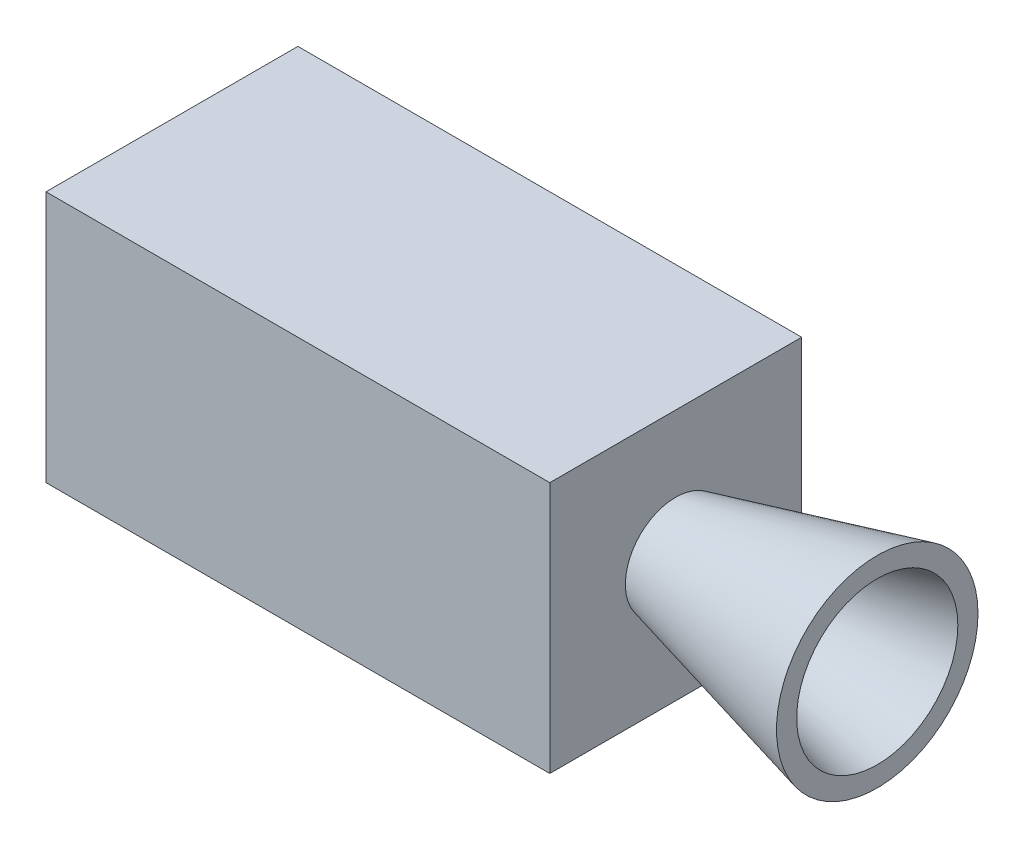
ISO-10303-21;
HEADER;
FILE_DESCRIPTION(('STEP AP214'),'2;1');
FILE_NAME('part.step','',(''),(''),'','','');
FILE_SCHEMA(('AUTOMOTIVE_DESIGN { 1 0 10303 214 1 1 1 1 }'));
ENDSEC;
DATA;
#1=APPLICATION_CONTEXT('core data for automotive mechanical design processes');
#2=APPLICATION_PROTOCOL_DEFINITION('international standard','automotive_design',2000,#1);
#3=PRODUCT_CONTEXT('',#1,'mechanical');
#4=PRODUCT('Part','Part','',(#3));
#5=PRODUCT_RELATED_PRODUCT_CATEGORY('part','',(#4));
#6=PRODUCT_DEFINITION_FORMATION('','',#4);
#7=PRODUCT_DEFINITION_CONTEXT('part definition',#1,'design');
#8=PRODUCT_DEFINITION('design','',#6,#7);
#9=PRODUCT_DEFINITION_SHAPE('','',#8);
#10=(LENGTH_UNIT() NAMED_UNIT(*) SI_UNIT(.MILLI.,.METRE.));
#11=(NAMED_UNIT(*) PLANE_ANGLE_UNIT() SI_UNIT($,.RADIAN.));
#12=(NAMED_UNIT(*) SI_UNIT($,.STERADIAN.) SOLID_ANGLE_UNIT());
#13=UNCERTAINTY_MEASURE_WITH_UNIT(LENGTH_MEASURE(1.E-05),#10,'distance_accuracy_value','');
#14=(GEOMETRIC_REPRESENTATION_CONTEXT(3) GLOBAL_UNCERTAINTY_ASSIGNED_CONTEXT((#13)) GLOBAL_UNIT_ASSIGNED_CONTEXT((#10,
#11,#12)) REPRESENTATION_CONTEXT('',''));
#15=CARTESIAN_POINT('',(0.,0.,0.));
#16=DIRECTION('',(0.,0.,1.));
#17=DIRECTION('',(1.,0.,0.));
#18=AXIS2_PLACEMENT_3D('',#15,#16,#17);
#19=CARTESIAN_POINT('',(0.,250.,-250.));
#20=DIRECTION('',(-1.,0.,0.));
#21=DIRECTION('',(0.,0.,1.));
#22=AXIS2_PLACEMENT_3D('',#19,#20,#21);
#23=PLANE('',#22);
#24=DIRECTION('',(0.,0.,1.));
#25=VECTOR('',#24,1.);
#26=CARTESIAN_POINT('',(0.,-250.,-250.));
#27=LINE('',#26,#25);
#28=CARTESIAN_POINT('',(0.,-250.,-250.));
#29=VERTEX_POINT('',#28);
#30=CARTESIAN_POINT('',(0.,-250.,250.));
#31=VERTEX_POINT('',#30);
#32=EDGE_CURVE('E42',#29,#31,#27,.T.);
#33=ORIENTED_EDGE('',*,*,#32,.T.);
#34=DIRECTION('',(0.,-1.,0.));
#35=VECTOR('',#34,1.);
#36=CARTESIAN_POINT('',(0.,250.,250.));
#37=LINE('',#36,#35);
#38=CARTESIAN_POINT('',(0.,250.,250.));
#39=VERTEX_POINT('',#38);
#40=EDGE_CURVE('E82',#39,#31,#37,.T.);
#41=ORIENTED_EDGE('',*,*,#40,.F.);
#42=DIRECTION('',(0.,0.,1.));
#43=VECTOR('',#42,1.);
#44=CARTESIAN_POINT('',(0.,250.,-250.));
#45=LINE('',#44,#43);
#46=CARTESIAN_POINT('',(0.,250.,-250.));
#47=VERTEX_POINT('',#46);
#48=EDGE_CURVE('E48',#47,#39,#45,.T.);
#49=ORIENTED_EDGE('',*,*,#48,.F.);
#50=DIRECTION('',(0.,-1.,0.));
#51=VECTOR('',#50,1.);
#52=CARTESIAN_POINT('',(0.,250.,-250.));
#53=LINE('',#52,#51);
#54=EDGE_CURVE('E83',#47,#29,#53,.T.);
#55=ORIENTED_EDGE('',*,*,#54,.T.);
#56=EDGE_LOOP('',(#33,#41,#49,#55));
#57=FACE_BOUND('',#56,.T.);
#58=ADVANCED_FACE('F39',(#57),#23,.T.);
#59=CARTESIAN_POINT('',(0.,250.,-250.));
#60=DIRECTION('',(0.,1.,0.));
#61=DIRECTION('',(0.,0.,1.));
#62=AXIS2_PLACEMENT_3D('',#59,#60,#61);
#63=PLANE('',#62);
#64=ORIENTED_EDGE('',*,*,#48,.T.);
#65=DIRECTION('',(-1.,0.,0.));
#66=VECTOR('',#65,1.);
#67=CARTESIAN_POINT('',(0.,250.,250.));
#68=LINE('',#67,#66);
#69=CARTESIAN_POINT('',(1000.,250.,250.));
#70=VERTEX_POINT('',#69);
#71=EDGE_CURVE('E101',#70,#39,#68,.T.);
#72=ORIENTED_EDGE('',*,*,#71,.F.);
#73=DIRECTION('',(0.,0.,1.));
#74=VECTOR('',#73,1.);
#75=CARTESIAN_POINT('',(1000.,250.,-250.));
#76=LINE('',#75,#74);
#77=CARTESIAN_POINT('',(1000.,250.,-250.));
#78=VERTEX_POINT('',#77);
#79=EDGE_CURVE('E63',#78,#70,#76,.T.);
#80=ORIENTED_EDGE('',*,*,#79,.F.);
#81=DIRECTION('',(-1.,0.,0.));
#82=VECTOR('',#81,1.);
#83=CARTESIAN_POINT('',(0.,250.,-250.));
#84=LINE('',#83,#82);
#85=EDGE_CURVE('E89',#78,#47,#84,.T.);
#86=ORIENTED_EDGE('',*,*,#85,.T.);
#87=EDGE_LOOP('',(#64,#72,#80,#86));
#88=FACE_BOUND('',#87,.T.);
#89=ADVANCED_FACE('F132',(#88),#63,.T.);
#90=CARTESIAN_POINT('',(1000.,250.,-250.));
#91=DIRECTION('',(1.,0.,0.));
#92=DIRECTION('',(0.,0.,-1.));
#93=AXIS2_PLACEMENT_3D('',#90,#91,#92);
#94=PLANE('',#93);
#95=CARTESIAN_POINT('',(1000.,0.,0.));
#96=DIRECTION('',(1.,0.,0.));
#97=DIRECTION('',(0.,0.,-1.));
#98=AXIS2_PLACEMENT_3D('',#95,#96,#97);
#99=CIRCLE('',#98,100.);
#100=CARTESIAN_POINT('',(1000.,0.,-100.));
#101=VERTEX_POINT('',#100);
#102=EDGE_CURVE('E11',#101,#101,#99,.T.);
#103=ORIENTED_EDGE('',*,*,#102,.F.);
#104=EDGE_LOOP('',(#103));
#105=FACE_BOUND('',#104,.T.);
#106=ORIENTED_EDGE('',*,*,#79,.T.);
#107=DIRECTION('',(0.,1.,0.));
#108=VECTOR('',#107,1.);
#109=CARTESIAN_POINT('',(1000.,250.,250.));
#110=LINE('',#109,#108);
#111=CARTESIAN_POINT('',(1000.,-250.,250.));
#112=VERTEX_POINT('',#111);
#113=EDGE_CURVE('E97',#112,#70,#110,.T.);
#114=ORIENTED_EDGE('',*,*,#113,.F.);
#115=DIRECTION('',(0.,0.,1.));
#116=VECTOR('',#115,1.);
#117=CARTESIAN_POINT('',(1000.,-250.,-250.));
#118=LINE('',#117,#116);
#119=CARTESIAN_POINT('',(1000.,-250.,-250.));
#120=VERTEX_POINT('',#119);
#121=EDGE_CURVE('E88',#120,#112,#118,.T.);
#122=ORIENTED_EDGE('',*,*,#121,.F.);
#123=DIRECTION('',(0.,1.,0.));
#124=VECTOR('',#123,1.);
#125=CARTESIAN_POINT('',(1000.,250.,-250.));
#126=LINE('',#125,#124);
#127=EDGE_CURVE('E119',#120,#78,#126,.T.);
#128=ORIENTED_EDGE('',*,*,#127,.T.);
#129=EDGE_LOOP('',(#106,#114,#122,#128));
#130=FACE_BOUND('',#129,.T.);
#131=ADVANCED_FACE('F129',(#105,#130),#94,.T.);
#132=CARTESIAN_POINT('',(0.,-250.,-250.));
#133=DIRECTION('',(0.,-1.,0.));
#134=DIRECTION('',(0.,0.,-1.));
#135=AXIS2_PLACEMENT_3D('',#132,#133,#134);
#136=PLANE('',#135);
#137=ORIENTED_EDGE('',*,*,#121,.T.);
#138=DIRECTION('',(1.,0.,0.));
#139=VECTOR('',#138,1.);
#140=CARTESIAN_POINT('',(0.,-250.,250.));
#141=LINE('',#140,#139);
#142=EDGE_CURVE('E91',#31,#112,#141,.T.);
#143=ORIENTED_EDGE('',*,*,#142,.F.);
#144=ORIENTED_EDGE('',*,*,#32,.F.);
#145=DIRECTION('',(1.,0.,0.));
#146=VECTOR('',#145,1.);
#147=CARTESIAN_POINT('',(0.,-250.,-250.));
#148=LINE('',#147,#146);
#149=EDGE_CURVE('E116',#29,#120,#148,.T.);
#150=ORIENTED_EDGE('',*,*,#149,.T.);
#151=EDGE_LOOP('',(#137,#143,#144,#150));
#152=FACE_BOUND('',#151,.T.);
#153=ADVANCED_FACE('F92',(#152),#136,.T.);
#154=CARTESIAN_POINT('',(0.,0.,-250.));
#155=DIRECTION('',(0.,0.,1.));
#156=DIRECTION('',(1.,0.,0.));
#157=AXIS2_PLACEMENT_3D('',#154,#155,#156);
#158=PLANE('',#157);
#159=ORIENTED_EDGE('',*,*,#54,.F.);
#160=ORIENTED_EDGE('',*,*,#85,.F.);
#161=ORIENTED_EDGE('',*,*,#127,.F.);
#162=ORIENTED_EDGE('',*,*,#149,.F.);
#163=EDGE_LOOP('',(#159,#160,#161,#162));
#164=FACE_BOUND('',#163,.T.);
#165=ADVANCED_FACE('F134',(#164),#158,.F.);
#166=CARTESIAN_POINT('',(0.,0.,250.));
#167=DIRECTION('',(0.,0.,1.));
#168=DIRECTION('',(1.,0.,0.));
#169=AXIS2_PLACEMENT_3D('',#166,#167,#168);
#170=PLANE('',#169);
#171=ORIENTED_EDGE('',*,*,#40,.T.);
#172=ORIENTED_EDGE('',*,*,#142,.T.);
#173=ORIENTED_EDGE('',*,*,#113,.T.);
#174=ORIENTED_EDGE('',*,*,#71,.T.);
#175=EDGE_LOOP('',(#171,#172,#173,#174));
#176=FACE_BOUND('',#175,.T.);
#177=ADVANCED_FACE('F100',(#176),#170,.T.);
#178=CARTESIAN_POINT('',(1400.,0.,0.));
#179=DIRECTION('',(1.,0.,0.));
#180=DIRECTION('',(0.,0.,-1.));
#181=AXIS2_PLACEMENT_3D('',#178,#179,#180);
#182=CONICAL_SURFACE('',#181,200.,0.244978663126864);
#183=ORIENTED_EDGE('',*,*,#102,.T.);
#184=EDGE_LOOP('',(#183));
#185=FACE_BOUND('',#184,.T.);
#186=CARTESIAN_POINT('',(1400.,0.,0.));
#187=DIRECTION('',(1.,0.,0.));
#188=DIRECTION('',(0.,0.,-1.));
#189=AXIS2_PLACEMENT_3D('',#186,#187,#188);
#190=CIRCLE('',#189,200.);
#191=CARTESIAN_POINT('',(1400.,0.,-200.));
#192=VERTEX_POINT('',#191);
#193=EDGE_CURVE('E103',#192,#192,#190,.T.);
#194=ORIENTED_EDGE('',*,*,#193,.F.);
#195=EDGE_LOOP('',(#194));
#196=FACE_BOUND('',#195,.T.);
#197=ADVANCED_FACE('F141',(#185,#196),#182,.T.);
#198=CARTESIAN_POINT('',(1400.,200.,0.));
#199=DIRECTION('',(1.,0.,0.));
#200=DIRECTION('',(0.,0.,-1.));
#201=AXIS2_PLACEMENT_3D('',#198,#199,#200);
#202=PLANE('',#201);
#203=ORIENTED_EDGE('',*,*,#193,.T.);
#204=EDGE_LOOP('',(#203));
#205=FACE_BOUND('',#204,.T.);
#206=CARTESIAN_POINT('',(1400.,0.,0.));
#207=DIRECTION('',(1.,0.,0.));
#208=DIRECTION('',(0.,0.,-1.));
#209=AXIS2_PLACEMENT_3D('',#206,#207,#208);
#210=CIRCLE('',#209,160.);
#211=CARTESIAN_POINT('',(1400.,0.,-160.));
#212=VERTEX_POINT('',#211);
#213=EDGE_CURVE('E107',#212,#212,#210,.T.);
#214=ORIENTED_EDGE('',*,*,#213,.F.);
#215=EDGE_LOOP('',(#214));
#216=FACE_BOUND('',#215,.T.);
#217=ADVANCED_FACE('F159',(#205,#216),#202,.T.);
#218=CARTESIAN_POINT('',(1040.,0.,0.));
#219=DIRECTION('',(1.,0.,0.));
#220=DIRECTION('',(0.,0.,-1.));
#221=AXIS2_PLACEMENT_3D('',#218,#219,#220);
#222=CONICAL_SURFACE('',#221,70.,0.244978663126865);
#223=ORIENTED_EDGE('',*,*,#213,.T.);
#224=EDGE_LOOP('',(#223));
#225=FACE_BOUND('',#224,.T.);
#226=CARTESIAN_POINT('',(1040.,0.,0.));
#227=DIRECTION('',(1.,0.,0.));
#228=DIRECTION('',(0.,0.,-1.));
#229=AXIS2_PLACEMENT_3D('',#226,#227,#228);
#230=CIRCLE('',#229,70.);
#231=CARTESIAN_POINT('',(1040.,0.,-70.));
#232=VERTEX_POINT('',#231);
#233=EDGE_CURVE('E171',#232,#232,#230,.T.);
#234=ORIENTED_EDGE('',*,*,#233,.F.);
#235=EDGE_LOOP('',(#234));
#236=FACE_BOUND('',#235,.T.);
#237=ADVANCED_FACE('F165',(#225,#236),#222,.F.);
#238=CARTESIAN_POINT('',(1040.,70.,0.));
#239=DIRECTION('',(1.,0.,0.));
#240=DIRECTION('',(0.,0.,-1.));
#241=AXIS2_PLACEMENT_3D('',#238,#239,#240);
#242=PLANE('',#241);
#243=ORIENTED_EDGE('',*,*,#233,.T.);
#244=EDGE_LOOP('',(#243));
#245=FACE_BOUND('',#244,.T.);
#246=ADVANCED_FACE('F178',(#245),#242,.T.);
#247=CLOSED_SHELL('',(#58,#89,#131,#153,#165,#177,#197,#217,#237,#246));
#248=MANIFOLD_SOLID_BREP('B2',#247);
#249=ADVANCED_BREP_SHAPE_REPRESENTATION('',(#18,#248),#14);
#250=SHAPE_DEFINITION_REPRESENTATION(#9,#249);
ENDSEC;
END-ISO-10303-21;
